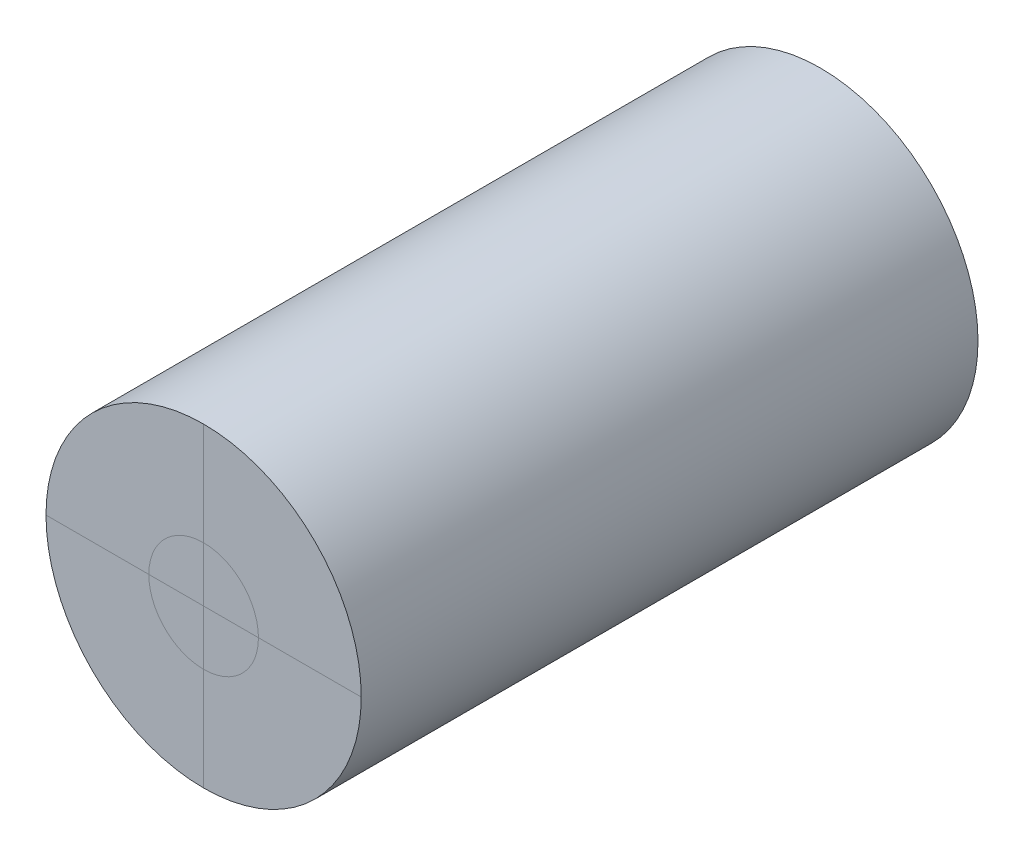
ISO-10303-21;
HEADER;
FILE_DESCRIPTION(('STEP AP214'),'2;1');
FILE_NAME('part.step','',(''),(''),'','','');
FILE_SCHEMA(('AUTOMOTIVE_DESIGN { 1 0 10303 214 1 1 1 1 }'));
ENDSEC;
DATA;
#1=APPLICATION_CONTEXT('core data for automotive mechanical design processes');
#2=APPLICATION_PROTOCOL_DEFINITION('international standard','automotive_design',2000,#1);
#3=PRODUCT_CONTEXT('',#1,'mechanical');
#4=PRODUCT('Part','Part','',(#3));
#5=PRODUCT_RELATED_PRODUCT_CATEGORY('part','',(#4));
#6=PRODUCT_DEFINITION_FORMATION('','',#4);
#7=PRODUCT_DEFINITION_CONTEXT('part definition',#1,'design');
#8=PRODUCT_DEFINITION('design','',#6,#7);
#9=PRODUCT_DEFINITION_SHAPE('','',#8);
#10=(LENGTH_UNIT() NAMED_UNIT(*) SI_UNIT(.MILLI.,.METRE.));
#11=(NAMED_UNIT(*) PLANE_ANGLE_UNIT() SI_UNIT($,.RADIAN.));
#12=(NAMED_UNIT(*) SI_UNIT($,.STERADIAN.) SOLID_ANGLE_UNIT());
#13=UNCERTAINTY_MEASURE_WITH_UNIT(LENGTH_MEASURE(1.E-05),#10,'distance_accuracy_value','');
#14=(GEOMETRIC_REPRESENTATION_CONTEXT(3) GLOBAL_UNCERTAINTY_ASSIGNED_CONTEXT((#13)) GLOBAL_UNIT_ASSIGNED_CONTEXT((#10,
#11,#12)) REPRESENTATION_CONTEXT('',''));
#15=CARTESIAN_POINT('',(0.,0.,0.));
#16=DIRECTION('',(0.,0.,1.));
#17=DIRECTION('',(1.,0.,0.));
#18=AXIS2_PLACEMENT_3D('',#15,#16,#17);
#19=CARTESIAN_POINT('',(0.,0.,57.15));
#20=DIRECTION('',(0.,0.,1.));
#21=DIRECTION('',(1.,0.,0.));
#22=AXIS2_PLACEMENT_3D('',#19,#20,#21);
#23=PLANE('',#22);
#24=CARTESIAN_POINT('',(0.,0.,57.15));
#25=DIRECTION('',(0.,0.,1.));
#26=DIRECTION('',(1.,0.,0.));
#27=AXIS2_PLACEMENT_3D('',#24,#25,#26);
#28=CIRCLE('',#27,14.605);
#29=CARTESIAN_POINT('',(-14.605,0.,57.15));
#30=VERTEX_POINT('',#29);
#31=CARTESIAN_POINT('',(0.,-14.605,57.15));
#32=VERTEX_POINT('',#31);
#33=EDGE_CURVE('E146',#30,#32,#28,.T.);
#34=ORIENTED_EDGE('',*,*,#33,.T.);
#35=DIRECTION('',(0.,1.,0.));
#36=VECTOR('',#35,1.);
#37=CARTESIAN_POINT('',(0.,0.,57.15));
#38=LINE('',#37,#36);
#39=CARTESIAN_POINT('',(0.,-5.08,57.15));
#40=VERTEX_POINT('',#39);
#41=EDGE_CURVE('E11',#32,#40,#38,.T.);
#42=ORIENTED_EDGE('',*,*,#41,.T.);
#43=CARTESIAN_POINT('',(0.,0.,57.15));
#44=DIRECTION('',(0.,0.,1.));
#45=DIRECTION('',(1.,0.,0.));
#46=AXIS2_PLACEMENT_3D('',#43,#44,#45);
#47=CIRCLE('',#46,5.08);
#48=CARTESIAN_POINT('',(-5.08,0.,57.15));
#49=VERTEX_POINT('',#48);
#50=EDGE_CURVE('E96',#40,#49,#47,.F.);
#51=ORIENTED_EDGE('',*,*,#50,.T.);
#52=DIRECTION('',(-1.,0.,0.));
#53=VECTOR('',#52,1.);
#54=CARTESIAN_POINT('',(0.,0.,57.15));
#55=LINE('',#54,#53);
#56=EDGE_CURVE('E102',#49,#30,#55,.T.);
#57=ORIENTED_EDGE('',*,*,#56,.T.);
#58=EDGE_LOOP('',(#34,#42,#51,#57));
#59=FACE_BOUND('',#58,.T.);
#60=ADVANCED_FACE('F36',(#59),#23,.T.);
#61=ORIENTED_EDGE('',*,*,#50,.F.);
#62=DIRECTION('',(0.,1.,0.));
#63=VECTOR('',#62,1.);
#64=CARTESIAN_POINT('',(0.,0.,57.15));
#65=LINE('',#64,#63);
#66=CARTESIAN_POINT('',(0.,0.,57.15));
#67=VERTEX_POINT('',#66);
#68=EDGE_CURVE('E46',#40,#67,#65,.T.);
#69=ORIENTED_EDGE('',*,*,#68,.T.);
#70=DIRECTION('',(-1.,0.,0.));
#71=VECTOR('',#70,1.);
#72=CARTESIAN_POINT('',(0.,0.,57.15));
#73=LINE('',#72,#71);
#74=EDGE_CURVE('E110',#67,#49,#73,.T.);
#75=ORIENTED_EDGE('',*,*,#74,.T.);
#76=EDGE_LOOP('',(#61,#69,#75));
#77=FACE_BOUND('',#76,.T.);
#78=ADVANCED_FACE('F144',(#77),#23,.T.);
#79=CARTESIAN_POINT('',(0.,5.08,57.15));
#80=VERTEX_POINT('',#79);
#81=EDGE_CURVE('E93',#49,#80,#47,.F.);
#82=ORIENTED_EDGE('',*,*,#81,.T.);
#83=DIRECTION('',(0.,1.,0.));
#84=VECTOR('',#83,1.);
#85=CARTESIAN_POINT('',(0.,0.,57.15));
#86=LINE('',#85,#84);
#87=CARTESIAN_POINT('',(0.,14.605,57.15));
#88=VERTEX_POINT('',#87);
#89=EDGE_CURVE('E86',#80,#88,#86,.T.);
#90=ORIENTED_EDGE('',*,*,#89,.T.);
#91=EDGE_CURVE('E149',#88,#30,#28,.T.);
#92=ORIENTED_EDGE('',*,*,#91,.T.);
#93=ORIENTED_EDGE('',*,*,#56,.F.);
#94=EDGE_LOOP('',(#82,#90,#92,#93));
#95=FACE_BOUND('',#94,.T.);
#96=ADVANCED_FACE('F129',(#95),#23,.T.);
#97=ORIENTED_EDGE('',*,*,#74,.F.);
#98=DIRECTION('',(0.,1.,0.));
#99=VECTOR('',#98,1.);
#100=CARTESIAN_POINT('',(0.,0.,57.15));
#101=LINE('',#100,#99);
#102=EDGE_CURVE('E40',#67,#80,#101,.T.);
#103=ORIENTED_EDGE('',*,*,#102,.T.);
#104=ORIENTED_EDGE('',*,*,#81,.F.);
#105=EDGE_LOOP('',(#97,#103,#104));
#106=FACE_BOUND('',#105,.T.);
#107=ADVANCED_FACE('F133',(#106),#23,.T.);
#108=ORIENTED_EDGE('',*,*,#41,.F.);
#109=CARTESIAN_POINT('',(14.605,0.,57.15));
#110=VERTEX_POINT('',#109);
#111=EDGE_CURVE('E100',#32,#110,#28,.T.);
#112=ORIENTED_EDGE('',*,*,#111,.T.);
#113=CARTESIAN_POINT('',(5.08,0.,57.15));
#114=VERTEX_POINT('',#113);
#115=EDGE_CURVE('E84',#110,#114,#55,.T.);
#116=ORIENTED_EDGE('',*,*,#115,.T.);
#117=EDGE_CURVE('E99',#114,#40,#47,.F.);
#118=ORIENTED_EDGE('',*,*,#117,.T.);
#119=EDGE_LOOP('',(#108,#112,#116,#118));
#120=FACE_BOUND('',#119,.T.);
#121=ADVANCED_FACE('F97',(#120),#23,.T.);
#122=ORIENTED_EDGE('',*,*,#68,.F.);
#123=ORIENTED_EDGE('',*,*,#117,.F.);
#124=EDGE_CURVE('E105',#114,#67,#73,.T.);
#125=ORIENTED_EDGE('',*,*,#124,.T.);
#126=EDGE_LOOP('',(#122,#123,#125));
#127=FACE_BOUND('',#126,.T.);
#128=ADVANCED_FACE('F112',(#127),#23,.T.);
#129=ORIENTED_EDGE('',*,*,#89,.F.);
#130=EDGE_CURVE('E80',#80,#114,#47,.F.);
#131=ORIENTED_EDGE('',*,*,#130,.T.);
#132=ORIENTED_EDGE('',*,*,#115,.F.);
#133=EDGE_CURVE('E94',#110,#88,#28,.T.);
#134=ORIENTED_EDGE('',*,*,#133,.T.);
#135=EDGE_LOOP('',(#129,#131,#132,#134));
#136=FACE_BOUND('',#135,.T.);
#137=ADVANCED_FACE('F82',(#136),#23,.T.);
#138=CARTESIAN_POINT('',(0.,0.,57.15));
#139=DIRECTION('',(0.,0.,-1.));
#140=DIRECTION('',(-1.,0.,0.));
#141=AXIS2_PLACEMENT_3D('',#138,#139,#140);
#142=CYLINDRICAL_SURFACE('',#141,14.605);
#143=ORIENTED_EDGE('',*,*,#133,.F.);
#144=ORIENTED_EDGE('',*,*,#111,.F.);
#145=ORIENTED_EDGE('',*,*,#33,.F.);
#146=ORIENTED_EDGE('',*,*,#91,.F.);
#147=EDGE_LOOP('',(#143,#144,#145,#146));
#148=FACE_BOUND('',#147,.T.);
#149=CARTESIAN_POINT('',(0.,0.,0.));
#150=DIRECTION('',(0.,0.,1.));
#151=DIRECTION('',(1.,0.,0.));
#152=AXIS2_PLACEMENT_3D('',#149,#150,#151);
#153=CIRCLE('',#152,14.605);
#154=CARTESIAN_POINT('',(14.605,0.,0.));
#155=VERTEX_POINT('',#154);
#156=EDGE_CURVE('E151',#155,#155,#153,.T.);
#157=ORIENTED_EDGE('',*,*,#156,.T.);
#158=EDGE_LOOP('',(#157));
#159=FACE_BOUND('',#158,.T.);
#160=ADVANCED_FACE('F38',(#148,#159),#142,.T.);
#161=ORIENTED_EDGE('',*,*,#102,.F.);
#162=ORIENTED_EDGE('',*,*,#124,.F.);
#163=ORIENTED_EDGE('',*,*,#130,.F.);
#164=EDGE_LOOP('',(#161,#162,#163));
#165=FACE_BOUND('',#164,.T.);
#166=ADVANCED_FACE('F106',(#165),#23,.T.);
#167=CARTESIAN_POINT('',(0.,0.,0.));
#168=DIRECTION('',(0.,0.,1.));
#169=DIRECTION('',(1.,0.,0.));
#170=AXIS2_PLACEMENT_3D('',#167,#168,#169);
#171=PLANE('',#170);
#172=ORIENTED_EDGE('',*,*,#156,.F.);
#173=EDGE_LOOP('',(#172));
#174=FACE_BOUND('',#173,.T.);
#175=ADVANCED_FACE('F155',(#174),#171,.F.);
#176=CLOSED_SHELL('',(#60,#78,#96,#107,#121,#128,#137,#160,#166,#175));
#177=MANIFOLD_SOLID_BREP('B2',#176);
#178=ADVANCED_BREP_SHAPE_REPRESENTATION('',(#18,#177),#14);
#179=SHAPE_DEFINITION_REPRESENTATION(#9,#178);
ENDSEC;
END-ISO-10303-21;
